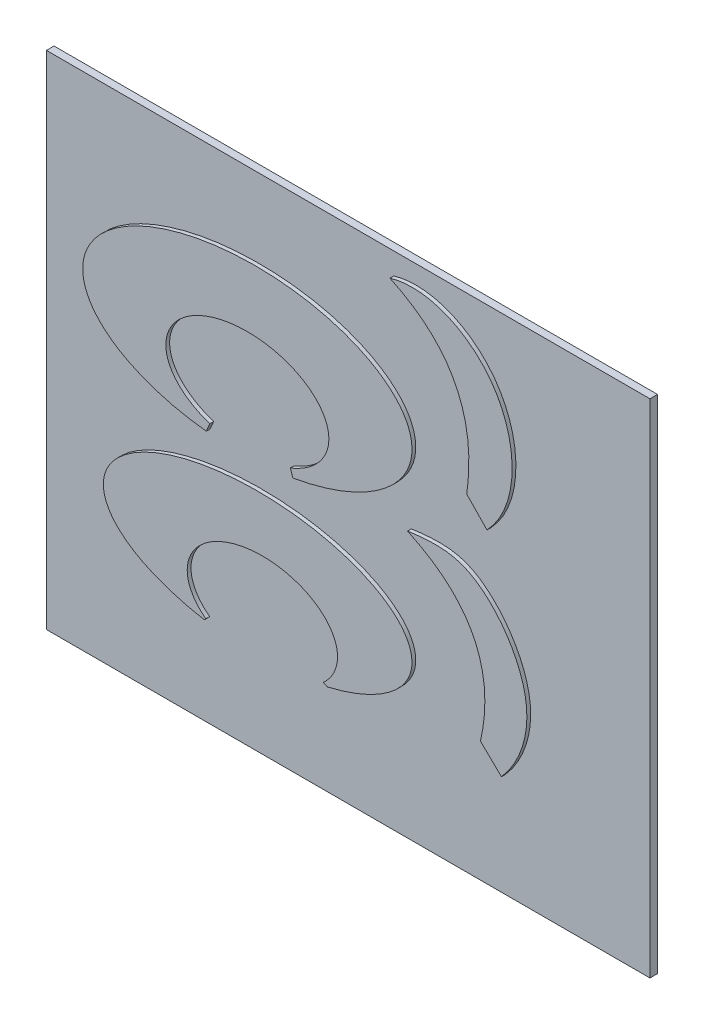
ISO-10303-21;
HEADER;
FILE_DESCRIPTION(('STEP AP214'),'2;1');
FILE_NAME('part.step','',(''),(''),'','','');
FILE_SCHEMA(('AUTOMOTIVE_DESIGN { 1 0 10303 214 1 1 1 1 }'));
ENDSEC;
DATA;
#1=APPLICATION_CONTEXT('core data for automotive mechanical design processes');
#2=APPLICATION_PROTOCOL_DEFINITION('international standard','automotive_design',2000,#1);
#3=PRODUCT_CONTEXT('',#1,'mechanical');
#4=PRODUCT('Part','Part','',(#3));
#5=PRODUCT_RELATED_PRODUCT_CATEGORY('part','',(#4));
#6=PRODUCT_DEFINITION_FORMATION('','',#4);
#7=PRODUCT_DEFINITION_CONTEXT('part definition',#1,'design');
#8=PRODUCT_DEFINITION('design','',#6,#7);
#9=PRODUCT_DEFINITION_SHAPE('','',#8);
#10=(LENGTH_UNIT() NAMED_UNIT(*) SI_UNIT(.MILLI.,.METRE.));
#11=(NAMED_UNIT(*) PLANE_ANGLE_UNIT() SI_UNIT($,.RADIAN.));
#12=(NAMED_UNIT(*) SI_UNIT($,.STERADIAN.) SOLID_ANGLE_UNIT());
#13=UNCERTAINTY_MEASURE_WITH_UNIT(LENGTH_MEASURE(1.E-05),#10,'distance_accuracy_value','');
#14=(GEOMETRIC_REPRESENTATION_CONTEXT(3) GLOBAL_UNCERTAINTY_ASSIGNED_CONTEXT((#13)) GLOBAL_UNIT_ASSIGNED_CONTEXT((#10,
#11,#12)) REPRESENTATION_CONTEXT('',''));
#15=CARTESIAN_POINT('',(0.,0.,0.));
#16=DIRECTION('',(0.,0.,1.));
#17=DIRECTION('',(1.,0.,0.));
#18=AXIS2_PLACEMENT_3D('',#15,#16,#17);
#19=CARTESIAN_POINT('',(-74.2105196698762,-4.27835061583061,-0.862895958889632));
#20=DIRECTION('',(0.,0.,1.));
#21=DIRECTION('',(1.,0.,0.));
#22=AXIS2_PLACEMENT_3D('',#19,#20,#21);
#23=PLANE('',#22);
#24=DIRECTION('',(0.388452138966321,0.921468901120645,0.));
#25=VECTOR('',#24,1.);
#26=CARTESIAN_POINT('',(-101.485886762429,-4.67560528698304,-0.862895958889632));
#27=LINE('',#26,#25);
#28=CARTESIAN_POINT('',(-101.718225394751,-5.22674866537536,-0.862895958889632));
#29=VERTEX_POINT('',#28);
#30=CARTESIAN_POINT('',(-101.485886762429,-4.67560528698304,-0.862895958889632));
#31=VERTEX_POINT('',#30);
#32=EDGE_CURVE('E190',#29,#31,#27,.T.);
#33=ORIENTED_EDGE('',*,*,#32,.F.);
#34=CARTESIAN_POINT('',(-98.9662898366164,0.344464543482891,-0.862895958889632));
#35=DIRECTION('',(0.,0.,1.));
#36=DIRECTION('',(0.999434189893676,0.0336348044675758,0.));
#37=AXIS2_PLACEMENT_3D('',#34,#35,#36);
#38=ELLIPSE('',#37,11.047102007925,5.68002589791727);
#39=CARTESIAN_POINT('',(-95.9093804097907,-5.04019330549207,-0.862895958889632));
#40=VERTEX_POINT('',#39);
#41=EDGE_CURVE('E187',#40,#29,#38,.T.);
#42=ORIENTED_EDGE('',*,*,#41,.F.);
#43=DIRECTION('',(0.331441129609116,-0.943475901972824,0.));
#44=VECTOR('',#43,1.);
#45=CARTESIAN_POINT('',(-96.0839061371072,-4.54339069625758,-0.862895958889632));
#46=LINE('',#45,#44);
#47=CARTESIAN_POINT('',(-96.0839061371072,-4.54339069625758,-0.862895958889632));
#48=VERTEX_POINT('',#47);
#49=EDGE_CURVE('E200',#48,#40,#46,.T.);
#50=ORIENTED_EDGE('',*,*,#49,.F.);
#51=CARTESIAN_POINT('',(-98.9662898366164,-1.56645205293385,-0.862895958889632));
#52=DIRECTION('',(0.,0.,-1.));
#53=DIRECTION('',(1.,0.,0.));
#54=AXIS2_PLACEMENT_3D('',#51,#52,#53);
#55=ELLIPSE('',#54,5.46734470641454,3.50334709343068);
#56=EDGE_CURVE('E398',#31,#48,#55,.T.);
#57=ORIENTED_EDGE('',*,*,#56,.F.);
#58=EDGE_LOOP('',(#33,#42,#50,#57));
#59=FACE_BOUND('',#58,.T.);
#60=CARTESIAN_POINT('',(-89.4053416509041,9.82287498412084,-0.862895958889632));
#61=CARTESIAN_POINT('',(-83.2254370913467,6.94824746325152,-0.862895958889632));
#62=CARTESIAN_POINT('',(-84.2538951151495,-0.139828221819649,-0.862895958889632));
#63=B_SPLINE_CURVE_WITH_KNOTS('',2,(#60,#61,#62),.UNSPECIFIED.,.F.,.F.,(3,3),(0.,1.),.UNSPECIFIED.);
#64=CARTESIAN_POINT('',(-89.4053416509041,9.82287498412084,-0.862895958889632));
#65=VERTEX_POINT('',#64);
#66=CARTESIAN_POINT('',(-84.2538951151495,-0.139828221819649,-0.862895958889632));
#67=VERTEX_POINT('',#66);
#68=EDGE_CURVE('E288',#65,#67,#63,.T.);
#69=ORIENTED_EDGE('',*,*,#68,.F.);
#70=CARTESIAN_POINT('',(-82.8931356528747,-1.54918623631855,-0.862895958889632));
#71=CARTESIAN_POINT('',(-80.6112485888083,0.843277937119984,-0.862895958889632));
#72=CARTESIAN_POINT('',(-80.8340329785659,7.88074199513661,-0.862895958889632));
#73=CARTESIAN_POINT('',(-86.9460091147513,10.5518414808285,-0.862895958889632));
#74=CARTESIAN_POINT('',(-89.4053416509041,9.82287498412084,-0.862895958889632));
#75=B_SPLINE_CURVE_WITH_KNOTS('',3,(#70,#71,#72,#73,#74),.UNSPECIFIED.,.F.,.F.,(4,1,4),(0.,
0.55873810738589,1.),.UNSPECIFIED.);
#76=CARTESIAN_POINT('',(-82.8931356528747,-1.54918623631855,-0.862895958889632));
#77=VERTEX_POINT('',#76);
#78=EDGE_CURVE('E296',#77,#65,#75,.T.);
#79=ORIENTED_EDGE('',*,*,#78,.F.);
#80=DIRECTION('',(0.694594513699566,-0.71940146061741,0.));
#81=VECTOR('',#80,1.);
#82=CARTESIAN_POINT('',(-84.2538951151495,-0.139828221819649,-0.862895958889632));
#83=LINE('',#82,#81);
#84=EDGE_CURVE('E599',#67,#77,#83,.T.);
#85=ORIENTED_EDGE('',*,*,#84,.F.);
#86=EDGE_LOOP('',(#69,#79,#85));
#87=FACE_BOUND('',#86,.T.);
#88=DIRECTION('',(0.,1.,0.));
#89=VECTOR('',#88,1.);
#90=CARTESIAN_POINT('',(-112.69457841502,-22.3648103011973,-0.862895958889632));
#91=LINE('',#90,#89);
#92=CARTESIAN_POINT('',(-112.69457841502,-22.3648103011973,-0.862895958889632));
#93=VERTEX_POINT('',#92);
#94=CARTESIAN_POINT('',(-112.69457841502,11.2821381694554,-0.862895958889632));
#95=VERTEX_POINT('',#94);
#96=EDGE_CURVE('E259',#93,#95,#91,.T.);
#97=ORIENTED_EDGE('',*,*,#96,.F.);
#98=DIRECTION('',(-1.,0.,0.));
#99=VECTOR('',#98,1.);
#100=CARTESIAN_POINT('',(-72.2142831132973,-22.3648103011973,-0.862895958889632));
#101=LINE('',#100,#99);
#102=CARTESIAN_POINT('',(-72.2142831132973,-22.3648103011973,-0.862895958889632));
#103=VERTEX_POINT('',#102);
#104=EDGE_CURVE('E264',#103,#93,#101,.T.);
#105=ORIENTED_EDGE('',*,*,#104,.F.);
#106=DIRECTION('',(0.,-1.,0.));
#107=VECTOR('',#106,1.);
#108=CARTESIAN_POINT('',(-72.2142831132973,-22.3648103011973,-0.862895958889632));
#109=LINE('',#108,#107);
#110=CARTESIAN_POINT('',(-72.2142831132973,11.2821381694554,-0.862895958889632));
#111=VERTEX_POINT('',#110);
#112=EDGE_CURVE('E275',#111,#103,#109,.T.);
#113=ORIENTED_EDGE('',*,*,#112,.F.);
#114=DIRECTION('',(1.,0.,0.));
#115=VECTOR('',#114,1.);
#116=CARTESIAN_POINT('',(-72.2142831132973,11.2821381694554,-0.862895958889632));
#117=LINE('',#116,#115);
#118=EDGE_CURVE('E273',#95,#111,#117,.T.);
#119=ORIENTED_EDGE('',*,*,#118,.F.);
#120=EDGE_LOOP('',(#97,#105,#113,#119));
#121=FACE_BOUND('',#120,.T.);
#122=DIRECTION('',(0.719401460617408,-0.694594513699568,0.));
#123=VECTOR('',#122,1.);
#124=CARTESIAN_POINT('',(-83.3305226228916,-14.0390141579122,-0.862895958889632));
#125=LINE('',#124,#123);
#126=CARTESIAN_POINT('',(-83.3305226228916,-14.0390141579122,-0.862895958889632));
#127=VERTEX_POINT('',#126);
#128=CARTESIAN_POINT('',(-81.9211646083927,-15.399773620187,-0.862895958889632));
#129=VERTEX_POINT('',#128);
#130=EDGE_CURVE('E238',#127,#129,#125,.T.);
#131=ORIENTED_EDGE('',*,*,#130,.F.);
#132=CARTESIAN_POINT('',(-88.2217341062607,-4.27835061583061,-0.862895958889632));
#133=CARTESIAN_POINT('',(-81.7945491594524,-7.26074301930615,-0.862895958889632));
#134=CARTESIAN_POINT('',(-83.3305226228916,-14.0390141579122,-0.862895958889632));
#135=B_SPLINE_CURVE_WITH_KNOTS('',2,(#132,#133,#134),.UNSPECIFIED.,.F.,.F.,(3,3),(0.,1.),.UNSPECIFIED.);
#136=CARTESIAN_POINT('',(-88.2217341062607,-4.27835061583061,-0.862895958889632));
#137=VERTEX_POINT('',#136);
#138=EDGE_CURVE('E230',#137,#127,#135,.T.);
#139=ORIENTED_EDGE('',*,*,#138,.F.);
#140=CARTESIAN_POINT('',(-81.9211646083927,-15.399773620187,-0.862895958889632));
#141=CARTESIAN_POINT('',(-80.6860685622194,-14.0049185461567,-0.862895958889632));
#142=CARTESIAN_POINT('',(-79.2460174200014,-9.97539756808537,-0.862895958889632));
#143=CARTESIAN_POINT('',(-83.1602595928017,-4.31518435396567,-0.862895958889632));
#144=CARTESIAN_POINT('',(-86.0149606504958,-3.96141613396085,-0.862895958889632));
#145=CARTESIAN_POINT('',(-88.2217341062607,-4.27835061583061,-0.862895958889632));
#146=B_SPLINE_CURVE_WITH_KNOTS('',3,(#140,#141,#142,#143,#144,#145),.UNSPECIFIED.,.F.,.F.,(4,1,
1,4),(0.,0.335432414125384,0.721969328304386,1.),.UNSPECIFIED.);
#147=EDGE_CURVE('E245',#129,#137,#146,.T.);
#148=ORIENTED_EDGE('',*,*,#147,.F.);
#149=EDGE_LOOP('',(#131,#139,#148));
#150=FACE_BOUND('',#149,.T.);
#151=DIRECTION('',(0.898422929317024,-0.439131233320311,0.));
#152=VECTOR('',#151,1.);
#153=CARTESIAN_POINT('',(-93.8677818476067,-15.8904699110442,-0.862895958889632));
#154=LINE('',#153,#152);
#155=CARTESIAN_POINT('',(-93.8677818476067,-15.8904699110442,-0.862895958889632));
#156=VERTEX_POINT('',#155);
#157=CARTESIAN_POINT('',(-93.6019046841402,-16.0204253728817,-0.862895958889632));
#158=VERTEX_POINT('',#157);
#159=EDGE_CURVE('E581',#156,#158,#154,.T.);
#160=ORIENTED_EDGE('',*,*,#159,.F.);
#161=CARTESIAN_POINT('',(-97.9577505218405,-13.9343289130742,-0.862895958889632));
#162=DIRECTION('',(0.,0.,-1.));
#163=DIRECTION('',(1.,0.,0.));
#164=AXIS2_PLACEMENT_3D('',#161,#162,#163);
#165=ELLIPSE('',#164,5.0426965738775,3.34410404372928);
#166=CARTESIAN_POINT('',(-101.751108936482,-16.1376924173525,-0.862895958889632));
#167=VERTEX_POINT('',#166);
#168=EDGE_CURVE('E185',#167,#156,#165,.T.);
#169=ORIENTED_EDGE('',*,*,#168,.F.);
#170=DIRECTION('',(0.673102291648878,0.739549393196309,0.));
#171=VECTOR('',#170,1.);
#172=CARTESIAN_POINT('',(-101.751108936482,-16.1376924173525,-0.862895958889632));
#173=LINE('',#172,#171);
#174=CARTESIAN_POINT('',(-101.846196325015,-16.2421666129734,-0.862895958889632));
#175=VERTEX_POINT('',#174);
#176=EDGE_CURVE('E181',#175,#167,#173,.T.);
#177=ORIENTED_EDGE('',*,*,#176,.F.);
#178=CARTESIAN_POINT('',(-98.2762366212439,-11.7580072338228,-0.862895958889632));
#179=DIRECTION('',(0.,0.,1.));
#180=DIRECTION('',(1.,0.,0.));
#181=AXIS2_PLACEMENT_3D('',#178,#179,#180);
#182=ELLIPSE('',#181,10.3507982305906,4.77729149104184);
#183=EDGE_CURVE('E578',#158,#175,#182,.T.);
#184=ORIENTED_EDGE('',*,*,#183,.F.);
#185=EDGE_LOOP('',(#160,#169,#177,#184));
#186=FACE_BOUND('',#185,.T.);
#187=ADVANCED_FACE('F35',(#59,#87,#121,#150,#186),#23,.T.);
#188=CARTESIAN_POINT('',(-89.4053416509041,9.82287498412084,-0.608895958889632));
#189=CARTESIAN_POINT('',(-83.2254370913467,6.94824746325152,-0.608895958889632));
#190=CARTESIAN_POINT('',(-84.2538951151495,-0.139828221819649,-0.608895958889632));
#191=B_SPLINE_CURVE_WITH_KNOTS('',2,(#188,#189,#190),.UNSPECIFIED.,.F.,.F.,(3,3),(0.,1.),.UNSPECIFIED.);
#192=DIRECTION('',(0.,0.,-1.));
#193=VECTOR('',#192,1.);
#194=SURFACE_OF_LINEAR_EXTRUSION('',#191,#193);
#195=ORIENTED_EDGE('',*,*,#68,.T.);
#196=DIRECTION('',(0.,0.,-1.));
#197=VECTOR('',#196,1.);
#198=CARTESIAN_POINT('',(-84.2538951151495,-0.139828221819649,-0.608895958889632));
#199=LINE('',#198,#197);
#200=CARTESIAN_POINT('',(-84.2538951151495,-0.139828221819649,-0.608895958889632));
#201=VERTEX_POINT('',#200);
#202=EDGE_CURVE('E11',#201,#67,#199,.T.);
#203=ORIENTED_EDGE('',*,*,#202,.F.);
#204=CARTESIAN_POINT('',(-89.4053416509041,9.82287498412084,-0.608895958889632));
#205=VERTEX_POINT('',#204);
#206=EDGE_CURVE('E289',#205,#201,#191,.T.);
#207=ORIENTED_EDGE('',*,*,#206,.F.);
#208=DIRECTION('',(0.,0.,-1.));
#209=VECTOR('',#208,1.);
#210=CARTESIAN_POINT('',(-89.4053416509041,9.82287498412084,-0.608895958889632));
#211=LINE('',#210,#209);
#212=EDGE_CURVE('E306',#205,#65,#211,.T.);
#213=ORIENTED_EDGE('',*,*,#212,.T.);
#214=EDGE_LOOP('',(#195,#203,#207,#213));
#215=FACE_BOUND('',#214,.T.);
#216=ADVANCED_FACE('F37',(#215),#194,.F.);
#217=CARTESIAN_POINT('',(-84.2538951151495,-0.139828221819649,-0.608895958889632));
#218=DIRECTION('',(0.71940146061741,0.694594513699566,0.));
#219=DIRECTION('',(-0.694594513699566,0.71940146061741,0.));
#220=AXIS2_PLACEMENT_3D('',#217,#218,#219);
#221=PLANE('',#220);
#222=ORIENTED_EDGE('',*,*,#84,.T.);
#223=DIRECTION('',(0.,0.,-1.));
#224=VECTOR('',#223,1.);
#225=CARTESIAN_POINT('',(-82.8931356528747,-1.54918623631855,-0.608895958889632));
#226=LINE('',#225,#224);
#227=CARTESIAN_POINT('',(-82.8931356528747,-1.54918623631855,-0.608895958889632));
#228=VERTEX_POINT('',#227);
#229=EDGE_CURVE('E44',#228,#77,#226,.T.);
#230=ORIENTED_EDGE('',*,*,#229,.F.);
#231=DIRECTION('',(0.694594513699566,-0.71940146061741,0.));
#232=VECTOR('',#231,1.);
#233=CARTESIAN_POINT('',(-84.2538951151495,-0.139828221819649,-0.608895958889632));
#234=LINE('',#233,#232);
#235=EDGE_CURVE('E295',#201,#228,#234,.T.);
#236=ORIENTED_EDGE('',*,*,#235,.F.);
#237=ORIENTED_EDGE('',*,*,#202,.T.);
#238=EDGE_LOOP('',(#222,#230,#236,#237));
#239=FACE_BOUND('',#238,.T.);
#240=ADVANCED_FACE('F318',(#239),#221,.F.);
#241=CARTESIAN_POINT('',(-82.8931356528747,-1.54918623631855,-0.608895958889632));
#242=CARTESIAN_POINT('',(-80.6112485888083,0.843277937119984,-0.608895958889632));
#243=CARTESIAN_POINT('',(-80.8340329785659,7.88074199513661,-0.608895958889632));
#244=CARTESIAN_POINT('',(-86.9460091147513,10.5518414808285,-0.608895958889632));
#245=CARTESIAN_POINT('',(-89.4053416509041,9.82287498412084,-0.608895958889632));
#246=B_SPLINE_CURVE_WITH_KNOTS('',3,(#241,#242,#243,#244,#245),.UNSPECIFIED.,.F.,.F.,(4,1,4),
(0.,0.55873810738589,1.),.UNSPECIFIED.);
#247=DIRECTION('',(0.,0.,-1.));
#248=VECTOR('',#247,1.);
#249=SURFACE_OF_LINEAR_EXTRUSION('',#246,#248);
#250=ORIENTED_EDGE('',*,*,#78,.T.);
#251=ORIENTED_EDGE('',*,*,#212,.F.);
#252=EDGE_CURVE('E301',#228,#205,#246,.T.);
#253=ORIENTED_EDGE('',*,*,#252,.F.);
#254=ORIENTED_EDGE('',*,*,#229,.T.);
#255=EDGE_LOOP('',(#250,#251,#253,#254));
#256=FACE_BOUND('',#255,.T.);
#257=ADVANCED_FACE('F314',(#256),#249,.F.);
#258=CARTESIAN_POINT('',(-85.0275277371867,5.89488542220106,-0.608895958889632));
#259=DIRECTION('',(0.,0.,1.));
#260=DIRECTION('',(1.,0.,0.));
#261=AXIS2_PLACEMENT_3D('',#258,#259,#260);
#262=PLANE('',#261);
#263=ORIENTED_EDGE('',*,*,#206,.T.);
#264=ORIENTED_EDGE('',*,*,#235,.T.);
#265=ORIENTED_EDGE('',*,*,#252,.T.);
#266=EDGE_LOOP('',(#263,#264,#265));
#267=FACE_BOUND('',#266,.T.);
#268=ADVANCED_FACE('F317',(#267),#262,.T.);
#269=CARTESIAN_POINT('',(-112.69457841502,-22.3648103011973,-1.37089595888963));
#270=DIRECTION('',(1.,0.,0.));
#271=DIRECTION('',(0.,0.,-1.));
#272=AXIS2_PLACEMENT_3D('',#269,#270,#271);
#273=PLANE('',#272);
#274=ORIENTED_EDGE('',*,*,#96,.T.);
#275=DIRECTION('',(0.,0.,1.));
#276=VECTOR('',#275,1.);
#277=CARTESIAN_POINT('',(-112.69457841502,11.2821381694554,-1.37089595888963));
#278=LINE('',#277,#276);
#279=CARTESIAN_POINT('',(-112.69457841502,11.2821381694554,-1.37089595888963));
#280=VERTEX_POINT('',#279);
#281=EDGE_CURVE('E286',#280,#95,#278,.T.);
#282=ORIENTED_EDGE('',*,*,#281,.F.);
#283=DIRECTION('',(0.,1.,0.));
#284=VECTOR('',#283,1.);
#285=CARTESIAN_POINT('',(-112.69457841502,-22.3648103011973,-1.37089595888963));
#286=LINE('',#285,#284);
#287=CARTESIAN_POINT('',(-112.69457841502,-22.3648103011973,-1.37089595888963));
#288=VERTEX_POINT('',#287);
#289=EDGE_CURVE('E260',#288,#280,#286,.T.);
#290=ORIENTED_EDGE('',*,*,#289,.F.);
#291=DIRECTION('',(0.,0.,1.));
#292=VECTOR('',#291,1.);
#293=CARTESIAN_POINT('',(-112.69457841502,-22.3648103011973,-1.37089595888963));
#294=LINE('',#293,#292);
#295=EDGE_CURVE('E270',#288,#93,#294,.T.);
#296=ORIENTED_EDGE('',*,*,#295,.T.);
#297=EDGE_LOOP('',(#274,#282,#290,#296));
#298=FACE_BOUND('',#297,.T.);
#299=ADVANCED_FACE('F350',(#298),#273,.F.);
#300=CARTESIAN_POINT('',(-72.2142831132973,11.2821381694554,-1.37089595888963));
#301=DIRECTION('',(0.,-1.,0.));
#302=DIRECTION('',(0.,0.,-1.));
#303=AXIS2_PLACEMENT_3D('',#300,#301,#302);
#304=PLANE('',#303);
#305=ORIENTED_EDGE('',*,*,#118,.T.);
#306=DIRECTION('',(0.,0.,1.));
#307=VECTOR('',#306,1.);
#308=CARTESIAN_POINT('',(-72.2142831132973,11.2821381694554,-1.37089595888963));
#309=LINE('',#308,#307);
#310=CARTESIAN_POINT('',(-72.2142831132973,11.2821381694554,-1.37089595888963));
#311=VERTEX_POINT('',#310);
#312=EDGE_CURVE('E283',#311,#111,#309,.T.);
#313=ORIENTED_EDGE('',*,*,#312,.F.);
#314=DIRECTION('',(1.,0.,0.));
#315=VECTOR('',#314,1.);
#316=CARTESIAN_POINT('',(-72.2142831132973,11.2821381694554,-1.37089595888963));
#317=LINE('',#316,#315);
#318=EDGE_CURVE('E263',#280,#311,#317,.T.);
#319=ORIENTED_EDGE('',*,*,#318,.F.);
#320=ORIENTED_EDGE('',*,*,#281,.T.);
#321=EDGE_LOOP('',(#305,#313,#319,#320));
#322=FACE_BOUND('',#321,.T.);
#323=ADVANCED_FACE('F347',(#322),#304,.F.);
#324=CARTESIAN_POINT('',(-72.2142831132973,-22.3648103011973,-1.37089595888963));
#325=DIRECTION('',(-1.,0.,0.));
#326=DIRECTION('',(0.,0.,1.));
#327=AXIS2_PLACEMENT_3D('',#324,#325,#326);
#328=PLANE('',#327);
#329=ORIENTED_EDGE('',*,*,#112,.T.);
#330=DIRECTION('',(0.,0.,1.));
#331=VECTOR('',#330,1.);
#332=CARTESIAN_POINT('',(-72.2142831132973,-22.3648103011973,-1.37089595888963));
#333=LINE('',#332,#331);
#334=CARTESIAN_POINT('',(-72.2142831132973,-22.3648103011973,-1.37089595888963));
#335=VERTEX_POINT('',#334);
#336=EDGE_CURVE('E280',#335,#103,#333,.T.);
#337=ORIENTED_EDGE('',*,*,#336,.F.);
#338=DIRECTION('',(0.,-1.,0.));
#339=VECTOR('',#338,1.);
#340=CARTESIAN_POINT('',(-72.2142831132973,-22.3648103011973,-1.37089595888963));
#341=LINE('',#340,#339);
#342=EDGE_CURVE('E266',#311,#335,#341,.T.);
#343=ORIENTED_EDGE('',*,*,#342,.F.);
#344=ORIENTED_EDGE('',*,*,#312,.T.);
#345=EDGE_LOOP('',(#329,#337,#343,#344));
#346=FACE_BOUND('',#345,.T.);
#347=ADVANCED_FACE('F343',(#346),#328,.F.);
#348=CARTESIAN_POINT('',(-72.2142831132973,-22.3648103011973,-1.37089595888963));
#349=DIRECTION('',(0.,1.,0.));
#350=DIRECTION('',(0.,0.,1.));
#351=AXIS2_PLACEMENT_3D('',#348,#349,#350);
#352=PLANE('',#351);
#353=ORIENTED_EDGE('',*,*,#104,.T.);
#354=ORIENTED_EDGE('',*,*,#295,.F.);
#355=DIRECTION('',(-1.,0.,0.));
#356=VECTOR('',#355,1.);
#357=CARTESIAN_POINT('',(-72.2142831132973,-22.3648103011973,-1.37089595888963));
#358=LINE('',#357,#356);
#359=EDGE_CURVE('E268',#335,#288,#358,.T.);
#360=ORIENTED_EDGE('',*,*,#359,.F.);
#361=ORIENTED_EDGE('',*,*,#336,.T.);
#362=EDGE_LOOP('',(#353,#354,#360,#361));
#363=FACE_BOUND('',#362,.T.);
#364=ADVANCED_FACE('F340',(#363),#352,.F.);
#365=CARTESIAN_POINT('',(-74.2105196698762,-4.27835061583061,-1.37089595888963));
#366=DIRECTION('',(0.,0.,1.));
#367=DIRECTION('',(1.,0.,0.));
#368=AXIS2_PLACEMENT_3D('',#365,#366,#367);
#369=PLANE('',#368);
#370=ORIENTED_EDGE('',*,*,#289,.T.);
#371=ORIENTED_EDGE('',*,*,#318,.T.);
#372=ORIENTED_EDGE('',*,*,#342,.T.);
#373=ORIENTED_EDGE('',*,*,#359,.T.);
#374=EDGE_LOOP('',(#370,#371,#372,#373));
#375=FACE_BOUND('',#374,.T.);
#376=ADVANCED_FACE('F339',(#375),#369,.F.);
#377=CARTESIAN_POINT('',(-88.2217341062607,-4.27835061583061,-0.608895958889632));
#378=CARTESIAN_POINT('',(-81.7945491594524,-7.26074301930615,-0.608895958889632));
#379=CARTESIAN_POINT('',(-83.3305226228916,-14.0390141579122,-0.608895958889632));
#380=B_SPLINE_CURVE_WITH_KNOTS('',2,(#377,#378,#379),.UNSPECIFIED.,.F.,.F.,(3,3),(0.,1.),.UNSPECIFIED.);
#381=DIRECTION('',(0.,0.,-1.));
#382=VECTOR('',#381,1.);
#383=SURFACE_OF_LINEAR_EXTRUSION('',#380,#382);
#384=ORIENTED_EDGE('',*,*,#138,.T.);
#385=DIRECTION('',(0.,0.,-1.));
#386=VECTOR('',#385,1.);
#387=CARTESIAN_POINT('',(-83.3305226228916,-14.0390141579122,-0.608895958889632));
#388=LINE('',#387,#386);
#389=CARTESIAN_POINT('',(-83.3305226228916,-14.0390141579122,-0.608895958889632));
#390=VERTEX_POINT('',#389);
#391=EDGE_CURVE('E257',#390,#127,#388,.T.);
#392=ORIENTED_EDGE('',*,*,#391,.F.);
#393=CARTESIAN_POINT('',(-88.2217341062607,-4.27835061583061,-0.608895958889632));
#394=VERTEX_POINT('',#393);
#395=EDGE_CURVE('E249',#394,#390,#380,.T.);
#396=ORIENTED_EDGE('',*,*,#395,.F.);
#397=DIRECTION('',(0.,0.,-1.));
#398=VECTOR('',#397,1.);
#399=CARTESIAN_POINT('',(-88.2217341062607,-4.27835061583061,-0.608895958889632));
#400=LINE('',#399,#398);
#401=EDGE_CURVE('E227',#394,#137,#400,.T.);
#402=ORIENTED_EDGE('',*,*,#401,.T.);
#403=EDGE_LOOP('',(#384,#392,#396,#402));
#404=FACE_BOUND('',#403,.T.);
#405=ADVANCED_FACE('F371',(#404),#383,.F.);
#406=CARTESIAN_POINT('',(-83.3305226228916,-14.0390141579122,-0.608895958889632));
#407=DIRECTION('',(0.694594513699568,0.719401460617408,0.));
#408=DIRECTION('',(-0.719401460617408,0.694594513699568,0.));
#409=AXIS2_PLACEMENT_3D('',#406,#407,#408);
#410=PLANE('',#409);
#411=ORIENTED_EDGE('',*,*,#130,.T.);
#412=DIRECTION('',(0.,0.,-1.));
#413=VECTOR('',#412,1.);
#414=CARTESIAN_POINT('',(-81.9211646083927,-15.399773620187,-0.608895958889632));
#415=LINE('',#414,#413);
#416=CARTESIAN_POINT('',(-81.9211646083927,-15.399773620187,-0.608895958889632));
#417=VERTEX_POINT('',#416);
#418=EDGE_CURVE('E255',#417,#129,#415,.T.);
#419=ORIENTED_EDGE('',*,*,#418,.F.);
#420=DIRECTION('',(0.719401460617408,-0.694594513699568,0.));
#421=VECTOR('',#420,1.);
#422=CARTESIAN_POINT('',(-83.3305226228916,-14.0390141579122,-0.608895958889632));
#423=LINE('',#422,#421);
#424=EDGE_CURVE('E228',#390,#417,#423,.T.);
#425=ORIENTED_EDGE('',*,*,#424,.F.);
#426=ORIENTED_EDGE('',*,*,#391,.T.);
#427=EDGE_LOOP('',(#411,#419,#425,#426));
#428=FACE_BOUND('',#427,.T.);
#429=ADVANCED_FACE('F218',(#428),#410,.F.);
#430=CARTESIAN_POINT('',(-81.9211646083927,-15.399773620187,-0.608895958889632));
#431=CARTESIAN_POINT('',(-80.6860685622194,-14.0049185461567,-0.608895958889632));
#432=CARTESIAN_POINT('',(-79.2460174200014,-9.97539756808537,-0.608895958889632));
#433=CARTESIAN_POINT('',(-83.1602595928017,-4.31518435396567,-0.608895958889632));
#434=CARTESIAN_POINT('',(-86.0149606504958,-3.96141613396085,-0.608895958889632));
#435=CARTESIAN_POINT('',(-88.2217341062607,-4.27835061583061,-0.608895958889632));
#436=B_SPLINE_CURVE_WITH_KNOTS('',3,(#430,#431,#432,#433,#434,#435),.UNSPECIFIED.,.F.,.F.,(4,1,
1,4),(0.,0.335432414125384,0.721969328304386,1.),.UNSPECIFIED.);
#437=DIRECTION('',(0.,0.,-1.));
#438=VECTOR('',#437,1.);
#439=SURFACE_OF_LINEAR_EXTRUSION('',#436,#438);
#440=ORIENTED_EDGE('',*,*,#147,.T.);
#441=ORIENTED_EDGE('',*,*,#401,.F.);
#442=EDGE_CURVE('E221',#417,#394,#436,.T.);
#443=ORIENTED_EDGE('',*,*,#442,.F.);
#444=ORIENTED_EDGE('',*,*,#418,.T.);
#445=EDGE_LOOP('',(#440,#441,#443,#444));
#446=FACE_BOUND('',#445,.T.);
#447=ADVANCED_FACE('F213',(#446),#439,.F.);
#448=CARTESIAN_POINT('',(-83.7853387620143,-8.20971270308879,-0.608895958889632));
#449=DIRECTION('',(0.,0.,1.));
#450=DIRECTION('',(1.,0.,0.));
#451=AXIS2_PLACEMENT_3D('',#448,#449,#450);
#452=PLANE('',#451);
#453=ORIENTED_EDGE('',*,*,#395,.T.);
#454=ORIENTED_EDGE('',*,*,#424,.T.);
#455=ORIENTED_EDGE('',*,*,#442,.T.);
#456=EDGE_LOOP('',(#453,#454,#455));
#457=FACE_BOUND('',#456,.T.);
#458=ADVANCED_FACE('F208',(#457),#452,.T.);
#459=CARTESIAN_POINT('',(-98.9662898366164,0.344464543482891,-0.608895958889632));
#460=DIRECTION('',(0.,0.,1.));
#461=DIRECTION('',(0.999434189893676,0.0336348044675758,0.));
#462=AXIS2_PLACEMENT_3D('',#459,#460,#461);
#463=ELLIPSE('',#462,11.047102007925,5.68002589791727);
#464=DIRECTION('',(0.,0.,-1.));
#465=VECTOR('',#464,1.);
#466=SURFACE_OF_LINEAR_EXTRUSION('',#463,#465);
#467=ORIENTED_EDGE('',*,*,#41,.T.);
#468=DIRECTION('',(0.,0.,-1.));
#469=VECTOR('',#468,1.);
#470=CARTESIAN_POINT('',(-101.718225394751,-5.22674866537536,-0.608895958889632));
#471=LINE('',#470,#469);
#472=CARTESIAN_POINT('',(-101.718225394751,-5.22674866537536,-0.608895958889632));
#473=VERTEX_POINT('',#472);
#474=EDGE_CURVE('E239',#473,#29,#471,.T.);
#475=ORIENTED_EDGE('',*,*,#474,.F.);
#476=CARTESIAN_POINT('',(-95.9093804097907,-5.04019330549207,-0.608895958889632));
#477=VERTEX_POINT('',#476);
#478=EDGE_CURVE('E195',#477,#473,#463,.T.);
#479=ORIENTED_EDGE('',*,*,#478,.F.);
#480=DIRECTION('',(0.,0.,-1.));
#481=VECTOR('',#480,1.);
#482=CARTESIAN_POINT('',(-95.9093804097907,-5.04019330549207,-0.608895958889632));
#483=LINE('',#482,#481);
#484=EDGE_CURVE('E393',#477,#40,#483,.T.);
#485=ORIENTED_EDGE('',*,*,#484,.T.);
#486=EDGE_LOOP('',(#467,#475,#479,#485));
#487=FACE_BOUND('',#486,.T.);
#488=ADVANCED_FACE('F203',(#487),#466,.F.);
#489=CARTESIAN_POINT('',(-101.485886762429,-4.67560528698304,-0.608895958889632));
#490=DIRECTION('',(-0.921468901120645,0.388452138966321,0.));
#491=DIRECTION('',(-0.388452138966321,-0.921468901120646,0.));
#492=AXIS2_PLACEMENT_3D('',#489,#490,#491);
#493=PLANE('',#492);
#494=ORIENTED_EDGE('',*,*,#32,.T.);
#495=DIRECTION('',(0.,0.,-1.));
#496=VECTOR('',#495,1.);
#497=CARTESIAN_POINT('',(-101.485886762429,-4.67560528698304,-0.608895958889632));
#498=LINE('',#497,#496);
#499=CARTESIAN_POINT('',(-101.485886762429,-4.67560528698304,-0.608895958889632));
#500=VERTEX_POINT('',#499);
#501=EDGE_CURVE('E389',#500,#31,#498,.T.);
#502=ORIENTED_EDGE('',*,*,#501,.F.);
#503=DIRECTION('',(0.388452138966321,0.921468901120645,0.));
#504=VECTOR('',#503,1.);
#505=CARTESIAN_POINT('',(-101.485886762429,-4.67560528698304,-0.608895958889632));
#506=LINE('',#505,#504);
#507=EDGE_CURVE('E199',#473,#500,#506,.T.);
#508=ORIENTED_EDGE('',*,*,#507,.F.);
#509=ORIENTED_EDGE('',*,*,#474,.T.);
#510=EDGE_LOOP('',(#494,#502,#508,#509));
#511=FACE_BOUND('',#510,.T.);
#512=ADVANCED_FACE('F207',(#511),#493,.F.);
#513=CARTESIAN_POINT('',(-98.9662898366164,-1.56645205293385,-0.608895958889632));
#514=DIRECTION('',(0.,0.,-1.));
#515=DIRECTION('',(1.,0.,0.));
#516=AXIS2_PLACEMENT_3D('',#513,#514,#515);
#517=ELLIPSE('',#516,5.46734470641454,3.50334709343068);
#518=DIRECTION('',(0.,0.,-1.));
#519=VECTOR('',#518,1.);
#520=SURFACE_OF_LINEAR_EXTRUSION('',#517,#519);
#521=ORIENTED_EDGE('',*,*,#56,.T.);
#522=DIRECTION('',(0.,0.,-1.));
#523=VECTOR('',#522,1.);
#524=CARTESIAN_POINT('',(-96.0839061371072,-4.54339069625758,-0.608895958889632));
#525=LINE('',#524,#523);
#526=CARTESIAN_POINT('',(-96.0839061371072,-4.54339069625758,-0.608895958889632));
#527=VERTEX_POINT('',#526);
#528=EDGE_CURVE('E59',#527,#48,#525,.T.);
#529=ORIENTED_EDGE('',*,*,#528,.F.);
#530=EDGE_CURVE('E401',#500,#527,#517,.T.);
#531=ORIENTED_EDGE('',*,*,#530,.F.);
#532=ORIENTED_EDGE('',*,*,#501,.T.);
#533=EDGE_LOOP('',(#521,#529,#531,#532));
#534=FACE_BOUND('',#533,.T.);
#535=ADVANCED_FACE('F403',(#534),#520,.F.);
#536=CARTESIAN_POINT('',(-96.0839061371072,-4.54339069625758,-0.608895958889632));
#537=DIRECTION('',(0.943475901972823,0.331441129609116,0.));
#538=DIRECTION('',(-0.331441129609116,0.943475901972823,0.));
#539=AXIS2_PLACEMENT_3D('',#536,#537,#538);
#540=PLANE('',#539);
#541=ORIENTED_EDGE('',*,*,#49,.T.);
#542=ORIENTED_EDGE('',*,*,#484,.F.);
#543=DIRECTION('',(0.331441129609116,-0.943475901972824,0.));
#544=VECTOR('',#543,1.);
#545=CARTESIAN_POINT('',(-96.0839061371072,-4.54339069625758,-0.608895958889632));
#546=LINE('',#545,#544);
#547=EDGE_CURVE('E396',#527,#477,#546,.T.);
#548=ORIENTED_EDGE('',*,*,#547,.F.);
#549=ORIENTED_EDGE('',*,*,#528,.T.);
#550=EDGE_LOOP('',(#541,#542,#548,#549));
#551=FACE_BOUND('',#550,.T.);
#552=ADVANCED_FACE('F406',(#551),#540,.F.);
#553=CARTESIAN_POINT('',(-98.9662898366164,0.344464543482891,-0.608895958889632));
#554=DIRECTION('',(0.,0.,1.));
#555=DIRECTION('',(1.,0.,0.));
#556=AXIS2_PLACEMENT_3D('',#553,#554,#555);
#557=PLANE('',#556);
#558=ORIENTED_EDGE('',*,*,#478,.T.);
#559=ORIENTED_EDGE('',*,*,#507,.T.);
#560=ORIENTED_EDGE('',*,*,#530,.T.);
#561=ORIENTED_EDGE('',*,*,#547,.T.);
#562=EDGE_LOOP('',(#558,#559,#560,#561));
#563=FACE_BOUND('',#562,.T.);
#564=ADVANCED_FACE('F410',(#563),#557,.T.);
#565=CARTESIAN_POINT('',(-97.9577505218405,-13.9343289130742,-0.608895958889632));
#566=DIRECTION('',(0.,0.,-1.));
#567=DIRECTION('',(1.,0.,0.));
#568=AXIS2_PLACEMENT_3D('',#565,#566,#567);
#569=ELLIPSE('',#568,5.0426965738775,3.34410404372928);
#570=DIRECTION('',(0.,0.,-1.));
#571=VECTOR('',#570,1.);
#572=SURFACE_OF_LINEAR_EXTRUSION('',#569,#571);
#573=ORIENTED_EDGE('',*,*,#168,.T.);
#574=DIRECTION('',(0.,0.,-1.));
#575=VECTOR('',#574,1.);
#576=CARTESIAN_POINT('',(-93.8677818476067,-15.8904699110442,-0.608895958889632));
#577=LINE('',#576,#575);
#578=CARTESIAN_POINT('',(-93.8677818476067,-15.8904699110442,-0.608895958889632));
#579=VERTEX_POINT('',#578);
#580=EDGE_CURVE('E166',#579,#156,#577,.T.);
#581=ORIENTED_EDGE('',*,*,#580,.F.);
#582=CARTESIAN_POINT('',(-101.751108936482,-16.1376924173525,-0.608895958889632));
#583=VERTEX_POINT('',#582);
#584=EDGE_CURVE('E173',#583,#579,#569,.T.);
#585=ORIENTED_EDGE('',*,*,#584,.F.);
#586=DIRECTION('',(0.,0.,-1.));
#587=VECTOR('',#586,1.);
#588=CARTESIAN_POINT('',(-101.751108936482,-16.1376924173525,-0.608895958889632));
#589=LINE('',#588,#587);
#590=EDGE_CURVE('E575',#583,#167,#589,.T.);
#591=ORIENTED_EDGE('',*,*,#590,.T.);
#592=EDGE_LOOP('',(#573,#581,#585,#591));
#593=FACE_BOUND('',#592,.T.);
#594=ADVANCED_FACE('F183',(#593),#572,.F.);
#595=CARTESIAN_POINT('',(-93.8677818476067,-15.8904699110442,-0.608895958889632));
#596=DIRECTION('',(0.439131233320311,0.898422929317024,0.));
#597=DIRECTION('',(-0.898422929317024,0.439131233320311,0.));
#598=AXIS2_PLACEMENT_3D('',#595,#596,#597);
#599=PLANE('',#598);
#600=ORIENTED_EDGE('',*,*,#159,.T.);
#601=DIRECTION('',(0.,0.,-1.));
#602=VECTOR('',#601,1.);
#603=CARTESIAN_POINT('',(-93.6019046841402,-16.0204253728817,-0.608895958889632));
#604=LINE('',#603,#602);
#605=CARTESIAN_POINT('',(-93.6019046841402,-16.0204253728817,-0.608895958889632));
#606=VERTEX_POINT('',#605);
#607=EDGE_CURVE('E169',#606,#158,#604,.T.);
#608=ORIENTED_EDGE('',*,*,#607,.F.);
#609=DIRECTION('',(0.898422929317024,-0.439131233320311,0.));
#610=VECTOR('',#609,1.);
#611=CARTESIAN_POINT('',(-93.8677818476067,-15.8904699110442,-0.608895958889632));
#612=LINE('',#611,#610);
#613=EDGE_CURVE('E162',#579,#606,#612,.T.);
#614=ORIENTED_EDGE('',*,*,#613,.F.);
#615=ORIENTED_EDGE('',*,*,#580,.T.);
#616=EDGE_LOOP('',(#600,#608,#614,#615));
#617=FACE_BOUND('',#616,.T.);
#618=ADVANCED_FACE('F164',(#617),#599,.F.);
#619=CARTESIAN_POINT('',(-98.2762366212439,-11.7580072338228,-0.608895958889632));
#620=DIRECTION('',(0.,0.,1.));
#621=DIRECTION('',(1.,0.,0.));
#622=AXIS2_PLACEMENT_3D('',#619,#620,#621);
#623=ELLIPSE('',#622,10.3507982305906,4.77729149104184);
#624=DIRECTION('',(0.,0.,-1.));
#625=VECTOR('',#624,1.);
#626=SURFACE_OF_LINEAR_EXTRUSION('',#623,#625);
#627=ORIENTED_EDGE('',*,*,#183,.T.);
#628=DIRECTION('',(0.,0.,-1.));
#629=VECTOR('',#628,1.);
#630=CARTESIAN_POINT('',(-101.846196325015,-16.2421666129734,-0.608895958889632));
#631=LINE('',#630,#629);
#632=CARTESIAN_POINT('',(-101.846196325015,-16.2421666129734,-0.608895958889632));
#633=VERTEX_POINT('',#632);
#634=EDGE_CURVE('E51',#633,#175,#631,.T.);
#635=ORIENTED_EDGE('',*,*,#634,.F.);
#636=EDGE_CURVE('E172',#606,#633,#623,.T.);
#637=ORIENTED_EDGE('',*,*,#636,.F.);
#638=ORIENTED_EDGE('',*,*,#607,.T.);
#639=EDGE_LOOP('',(#627,#635,#637,#638));
#640=FACE_BOUND('',#639,.T.);
#641=ADVANCED_FACE('F422',(#640),#626,.F.);
#642=CARTESIAN_POINT('',(-101.751108936482,-16.1376924173525,-0.608895958889632));
#643=DIRECTION('',(-0.739549393196309,0.673102291648878,0.));
#644=DIRECTION('',(-0.673102291648878,-0.739549393196309,0.));
#645=AXIS2_PLACEMENT_3D('',#642,#643,#644);
#646=PLANE('',#645);
#647=ORIENTED_EDGE('',*,*,#176,.T.);
#648=ORIENTED_EDGE('',*,*,#590,.F.);
#649=DIRECTION('',(0.673102291648878,0.739549393196309,0.));
#650=VECTOR('',#649,1.);
#651=CARTESIAN_POINT('',(-101.751108936482,-16.1376924173525,-0.608895958889632));
#652=LINE('',#651,#650);
#653=EDGE_CURVE('E177',#633,#583,#652,.T.);
#654=ORIENTED_EDGE('',*,*,#653,.F.);
#655=ORIENTED_EDGE('',*,*,#634,.T.);
#656=EDGE_LOOP('',(#647,#648,#654,#655));
#657=FACE_BOUND('',#656,.T.);
#658=ADVANCED_FACE('F425',(#657),#646,.F.);
#659=CARTESIAN_POINT('',(-97.9577505218405,-13.9343289130742,-0.608895958889632));
#660=DIRECTION('',(0.,0.,1.));
#661=DIRECTION('',(1.,0.,0.));
#662=AXIS2_PLACEMENT_3D('',#659,#660,#661);
#663=PLANE('',#662);
#664=ORIENTED_EDGE('',*,*,#584,.T.);
#665=ORIENTED_EDGE('',*,*,#613,.T.);
#666=ORIENTED_EDGE('',*,*,#636,.T.);
#667=ORIENTED_EDGE('',*,*,#653,.T.);
#668=EDGE_LOOP('',(#664,#665,#666,#667));
#669=FACE_BOUND('',#668,.T.);
#670=ADVANCED_FACE('F176',(#669),#663,.T.);
#671=CLOSED_SHELL('',(#187,#216,#240,#257,#268,#299,#323,#347,#364,#376,#405,#429,#447,#458,
#488,#512,#535,#552,#564,#594,#618,#641,#658,#670));
#672=MANIFOLD_SOLID_BREP('B2',#671);
#673=ADVANCED_BREP_SHAPE_REPRESENTATION('',(#18,#672),#14);
#674=SHAPE_DEFINITION_REPRESENTATION(#9,#673);
ENDSEC;
END-ISO-10303-21;
